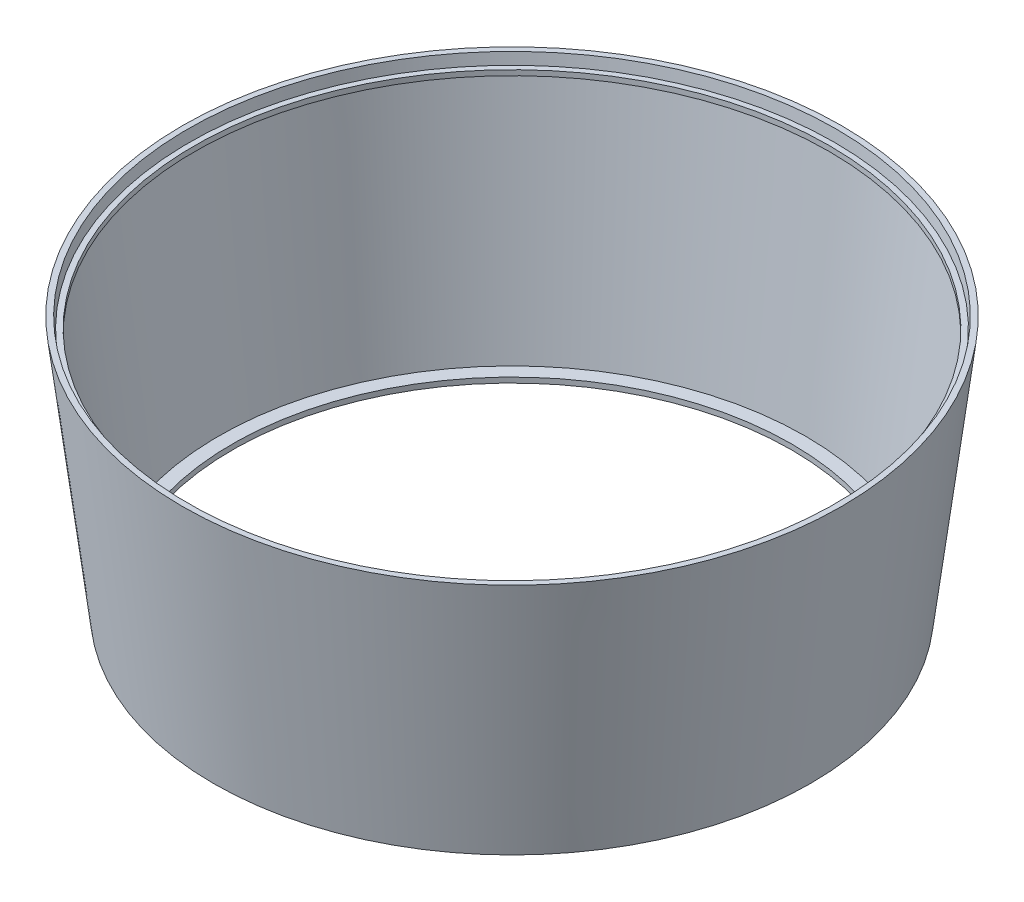
ISO-10303-21;
HEADER;
FILE_DESCRIPTION(('STEP AP214'),'2;1');
FILE_NAME('part.step','',(''),(''),'','','');
FILE_SCHEMA(('AUTOMOTIVE_DESIGN { 1 0 10303 214 1 1 1 1 }'));
ENDSEC;
DATA;
#1=APPLICATION_CONTEXT('core data for automotive mechanical design processes');
#2=APPLICATION_PROTOCOL_DEFINITION('international standard','automotive_design',2000,#1);
#3=PRODUCT_CONTEXT('',#1,'mechanical');
#4=PRODUCT('Part','Part','',(#3));
#5=PRODUCT_RELATED_PRODUCT_CATEGORY('part','',(#4));
#6=PRODUCT_DEFINITION_FORMATION('','',#4);
#7=PRODUCT_DEFINITION_CONTEXT('part definition',#1,'design');
#8=PRODUCT_DEFINITION('design','',#6,#7);
#9=PRODUCT_DEFINITION_SHAPE('','',#8);
#10=(LENGTH_UNIT() NAMED_UNIT(*) SI_UNIT(.MILLI.,.METRE.));
#11=(NAMED_UNIT(*) PLANE_ANGLE_UNIT() SI_UNIT($,.RADIAN.));
#12=(NAMED_UNIT(*) SI_UNIT($,.STERADIAN.) SOLID_ANGLE_UNIT());
#13=UNCERTAINTY_MEASURE_WITH_UNIT(LENGTH_MEASURE(1.E-05),#10,'distance_accuracy_value','');
#14=(GEOMETRIC_REPRESENTATION_CONTEXT(3) GLOBAL_UNCERTAINTY_ASSIGNED_CONTEXT((#13)) GLOBAL_UNIT_ASSIGNED_CONTEXT((#10,
#11,#12)) REPRESENTATION_CONTEXT('',''));
#15=CARTESIAN_POINT('',(0.,0.,0.));
#16=DIRECTION('',(0.,0.,1.));
#17=DIRECTION('',(1.,0.,0.));
#18=AXIS2_PLACEMENT_3D('',#15,#16,#17);
#19=CARTESIAN_POINT('',(-752.,0.,0.));
#20=DIRECTION('',(0.,-1.,0.));
#21=DIRECTION('',(0.,0.,-1.));
#22=AXIS2_PLACEMENT_3D('',#19,#20,#21);
#23=CYLINDRICAL_SURFACE('',#22,752.);
#24=CARTESIAN_POINT('',(-752.,0.,0.));
#25=DIRECTION('',(0.,-1.,0.));
#26=DIRECTION('',(0.,0.,-1.));
#27=AXIS2_PLACEMENT_3D('',#24,#25,#26);
#28=CIRCLE('',#27,752.);
#29=CARTESIAN_POINT('',(-752.,0.,-752.));
#30=VERTEX_POINT('',#29);
#31=EDGE_CURVE('E68',#30,#30,#28,.T.);
#32=ORIENTED_EDGE('',*,*,#31,.T.);
#33=EDGE_LOOP('',(#32));
#34=FACE_BOUND('',#33,.T.);
#35=CARTESIAN_POINT('',(-752.,14.,0.));
#36=DIRECTION('',(0.,-1.,0.));
#37=DIRECTION('',(0.,0.,-1.));
#38=AXIS2_PLACEMENT_3D('',#35,#36,#37);
#39=CIRCLE('',#38,752.);
#40=CARTESIAN_POINT('',(-752.,14.,-752.));
#41=VERTEX_POINT('',#40);
#42=EDGE_CURVE('E10',#41,#41,#39,.T.);
#43=ORIENTED_EDGE('',*,*,#42,.F.);
#44=EDGE_LOOP('',(#43));
#45=FACE_BOUND('',#44,.T.);
#46=ADVANCED_FACE('F34',(#34,#45),#23,.F.);
#47=CARTESIAN_POINT('',(0.,14.,0.));
#48=DIRECTION('',(0.,1.,0.));
#49=DIRECTION('',(0.,0.,1.));
#50=AXIS2_PLACEMENT_3D('',#47,#48,#49);
#51=PLANE('',#50);
#52=ORIENTED_EDGE('',*,*,#42,.T.);
#53=EDGE_LOOP('',(#52));
#54=FACE_BOUND('',#53,.T.);
#55=CARTESIAN_POINT('',(-752.,14.0000000000001,0.));
#56=DIRECTION('',(0.,-1.,0.));
#57=DIRECTION('',(0.,0.,-1.));
#58=AXIS2_PLACEMENT_3D('',#55,#56,#57);
#59=CIRCLE('',#58,788.718983852641);
#60=CARTESIAN_POINT('',(-752.,14.0000000000001,-788.718983852641));
#61=VERTEX_POINT('',#60);
#62=EDGE_CURVE('E40',#61,#61,#59,.T.);
#63=ORIENTED_EDGE('',*,*,#62,.F.);
#64=EDGE_LOOP('',(#63));
#65=FACE_BOUND('',#64,.T.);
#66=ADVANCED_FACE('F86',(#54,#65),#51,.T.);
#67=CARTESIAN_POINT('',(-752.,644.058098538197,0.));
#68=DIRECTION('',(0.,1.,0.));
#69=DIRECTION('',(0.,0.,1.));
#70=AXIS2_PLACEMENT_3D('',#67,#68,#69);
#71=CONICAL_SURFACE('',#70,866.08039082497,0.122173047639599);
#72=ORIENTED_EDGE('',*,*,#62,.T.);
#73=EDGE_LOOP('',(#72));
#74=FACE_BOUND('',#73,.T.);
#75=CARTESIAN_POINT('',(-752.,644.058098538197,0.));
#76=DIRECTION('',(0.,-1.,0.));
#77=DIRECTION('',(0.,0.,-1.));
#78=AXIS2_PLACEMENT_3D('',#75,#76,#77);
#79=CIRCLE('',#78,866.08039082497);
#80=CARTESIAN_POINT('',(-752.,644.058098538197,-866.08039082497));
#81=VERTEX_POINT('',#80);
#82=EDGE_CURVE('E44',#81,#81,#79,.T.);
#83=ORIENTED_EDGE('',*,*,#82,.F.);
#84=EDGE_LOOP('',(#83));
#85=FACE_BOUND('',#84,.T.);
#86=ADVANCED_FACE('F90',(#74,#85),#71,.F.);
#87=CARTESIAN_POINT('',(101.359374677611,644.058098538197,0.));
#88=DIRECTION('',(0.,-1.,0.));
#89=DIRECTION('',(0.,0.,-1.));
#90=AXIS2_PLACEMENT_3D('',#87,#88,#89);
#91=PLANE('',#90);
#92=ORIENTED_EDGE('',*,*,#82,.T.);
#93=EDGE_LOOP('',(#92));
#94=FACE_BOUND('',#93,.T.);
#95=CARTESIAN_POINT('',(-752.,644.058098538197,0.));
#96=DIRECTION('',(0.,-1.,0.));
#97=DIRECTION('',(0.,0.,-1.));
#98=AXIS2_PLACEMENT_3D('',#95,#96,#97);
#99=CIRCLE('',#98,853.359374677611);
#100=CARTESIAN_POINT('',(-752.,644.058098538197,-853.359374677611));
#101=VERTEX_POINT('',#100);
#102=EDGE_CURVE('E48',#101,#101,#99,.T.);
#103=ORIENTED_EDGE('',*,*,#102,.F.);
#104=EDGE_LOOP('',(#103));
#105=FACE_BOUND('',#104,.T.);
#106=ADVANCED_FACE('F94',(#94,#105),#91,.T.);
#107=CARTESIAN_POINT('',(-752.,0.,0.));
#108=DIRECTION('',(0.,-1.,0.));
#109=DIRECTION('',(0.,0.,-1.));
#110=AXIS2_PLACEMENT_3D('',#107,#108,#109);
#111=CYLINDRICAL_SURFACE('',#110,853.359374677611);
#112=ORIENTED_EDGE('',*,*,#102,.T.);
#113=EDGE_LOOP('',(#112));
#114=FACE_BOUND('',#113,.T.);
#115=CARTESIAN_POINT('',(-752.,658.058098538197,0.));
#116=DIRECTION('',(0.,-1.,0.));
#117=DIRECTION('',(0.,0.,-1.));
#118=AXIS2_PLACEMENT_3D('',#115,#116,#117);
#119=CIRCLE('',#118,853.359374677611);
#120=CARTESIAN_POINT('',(-752.,658.058098538197,-853.359374677611));
#121=VERTEX_POINT('',#120);
#122=EDGE_CURVE('E53',#121,#121,#119,.T.);
#123=ORIENTED_EDGE('',*,*,#122,.F.);
#124=EDGE_LOOP('',(#123));
#125=FACE_BOUND('',#124,.T.);
#126=ADVANCED_FACE('F100',(#114,#125),#111,.F.);
#127=CARTESIAN_POINT('',(115.799374677611,658.058098538197,0.));
#128=DIRECTION('',(0.,1.,0.));
#129=DIRECTION('',(0.,0.,1.));
#130=AXIS2_PLACEMENT_3D('',#127,#128,#129);
#131=PLANE('',#130);
#132=ORIENTED_EDGE('',*,*,#122,.T.);
#133=EDGE_LOOP('',(#132));
#134=FACE_BOUND('',#133,.T.);
#135=CARTESIAN_POINT('',(-752.,658.058098538197,0.));
#136=DIRECTION('',(0.,-1.,0.));
#137=DIRECTION('',(0.,0.,-1.));
#138=AXIS2_PLACEMENT_3D('',#135,#136,#137);
#139=CIRCLE('',#138,867.79937467761);
#140=CARTESIAN_POINT('',(-752.,658.058098538197,-867.79937467761));
#141=VERTEX_POINT('',#140);
#142=EDGE_CURVE('E56',#141,#141,#139,.T.);
#143=ORIENTED_EDGE('',*,*,#142,.F.);
#144=EDGE_LOOP('',(#143));
#145=FACE_BOUND('',#144,.T.);
#146=ADVANCED_FACE('F104',(#134,#145),#131,.T.);
#147=CARTESIAN_POINT('',(-752.,687.834483087436,0.));
#148=DIRECTION('',(0.,1.,0.));
#149=DIRECTION('',(0.,0.,1.));
#150=AXIS2_PLACEMENT_3D('',#147,#148,#149);
#151=CONICAL_SURFACE('',#150,871.455454979765,0.122173047639601);
#152=ORIENTED_EDGE('',*,*,#142,.T.);
#153=EDGE_LOOP('',(#152));
#154=FACE_BOUND('',#153,.T.);
#155=CARTESIAN_POINT('',(-752.,687.834483087436,0.));
#156=DIRECTION('',(0.,-1.,0.));
#157=DIRECTION('',(0.,0.,-1.));
#158=AXIS2_PLACEMENT_3D('',#155,#156,#157);
#159=CIRCLE('',#158,871.455454979765);
#160=CARTESIAN_POINT('',(-752.,687.834483087436,-871.455454979765));
#161=VERTEX_POINT('',#160);
#162=EDGE_CURVE('E59',#161,#161,#159,.T.);
#163=ORIENTED_EDGE('',*,*,#162,.F.);
#164=EDGE_LOOP('',(#163));
#165=FACE_BOUND('',#164,.T.);
#166=ADVANCED_FACE('F108',(#154,#165),#151,.F.);
#167=CARTESIAN_POINT('',(134.455454979765,687.834483087436,0.));
#168=DIRECTION('',(0.,1.,0.));
#169=DIRECTION('',(0.,0.,1.));
#170=AXIS2_PLACEMENT_3D('',#167,#168,#169);
#171=PLANE('',#170);
#172=ORIENTED_EDGE('',*,*,#162,.T.);
#173=EDGE_LOOP('',(#172));
#174=FACE_BOUND('',#173,.T.);
#175=CARTESIAN_POINT('',(-752.,687.834483087436,0.));
#176=DIRECTION('',(0.,-1.,0.));
#177=DIRECTION('',(0.,0.,-1.));
#178=AXIS2_PLACEMENT_3D('',#175,#176,#177);
#179=CIRCLE('',#178,886.455454979765);
#180=CARTESIAN_POINT('',(-752.,687.834483087436,-886.455454979765));
#181=VERTEX_POINT('',#180);
#182=EDGE_CURVE('E62',#181,#181,#179,.T.);
#183=ORIENTED_EDGE('',*,*,#182,.F.);
#184=EDGE_LOOP('',(#183));
#185=FACE_BOUND('',#184,.T.);
#186=ADVANCED_FACE('F82',(#174,#185),#171,.T.);
#187=CARTESIAN_POINT('',(-752.,0.,0.));
#188=DIRECTION('',(0.,1.,0.));
#189=DIRECTION('',(0.,0.,1.));
#190=AXIS2_PLACEMENT_3D('',#187,#188,#189);
#191=CONICAL_SURFACE('',#190,802.,0.1221730476396);
#192=ORIENTED_EDGE('',*,*,#182,.T.);
#193=EDGE_LOOP('',(#192));
#194=FACE_BOUND('',#193,.T.);
#195=CARTESIAN_POINT('',(-752.,0.,0.));
#196=DIRECTION('',(0.,-1.,0.));
#197=DIRECTION('',(0.,0.,-1.));
#198=AXIS2_PLACEMENT_3D('',#195,#196,#197);
#199=CIRCLE('',#198,802.);
#200=CARTESIAN_POINT('',(-752.,0.,-802.));
#201=VERTEX_POINT('',#200);
#202=EDGE_CURVE('E65',#201,#201,#199,.T.);
#203=ORIENTED_EDGE('',*,*,#202,.F.);
#204=EDGE_LOOP('',(#203));
#205=FACE_BOUND('',#204,.T.);
#206=ADVANCED_FACE('F76',(#194,#205),#191,.T.);
#207=CARTESIAN_POINT('',(0.,0.,0.));
#208=DIRECTION('',(0.,-1.,0.));
#209=DIRECTION('',(0.,0.,-1.));
#210=AXIS2_PLACEMENT_3D('',#207,#208,#209);
#211=PLANE('',#210);
#212=ORIENTED_EDGE('',*,*,#202,.T.);
#213=EDGE_LOOP('',(#212));
#214=FACE_BOUND('',#213,.T.);
#215=ORIENTED_EDGE('',*,*,#31,.F.);
#216=EDGE_LOOP('',(#215));
#217=FACE_BOUND('',#216,.T.);
#218=ADVANCED_FACE('F74',(#214,#217),#211,.T.);
#219=CLOSED_SHELL('',(#46,#66,#86,#106,#126,#146,#166,#186,#206,#218));
#220=MANIFOLD_SOLID_BREP('B2',#219);
#221=ADVANCED_BREP_SHAPE_REPRESENTATION('',(#18,#220),#14);
#222=SHAPE_DEFINITION_REPRESENTATION(#9,#221);
ENDSEC;
END-ISO-10303-21;
